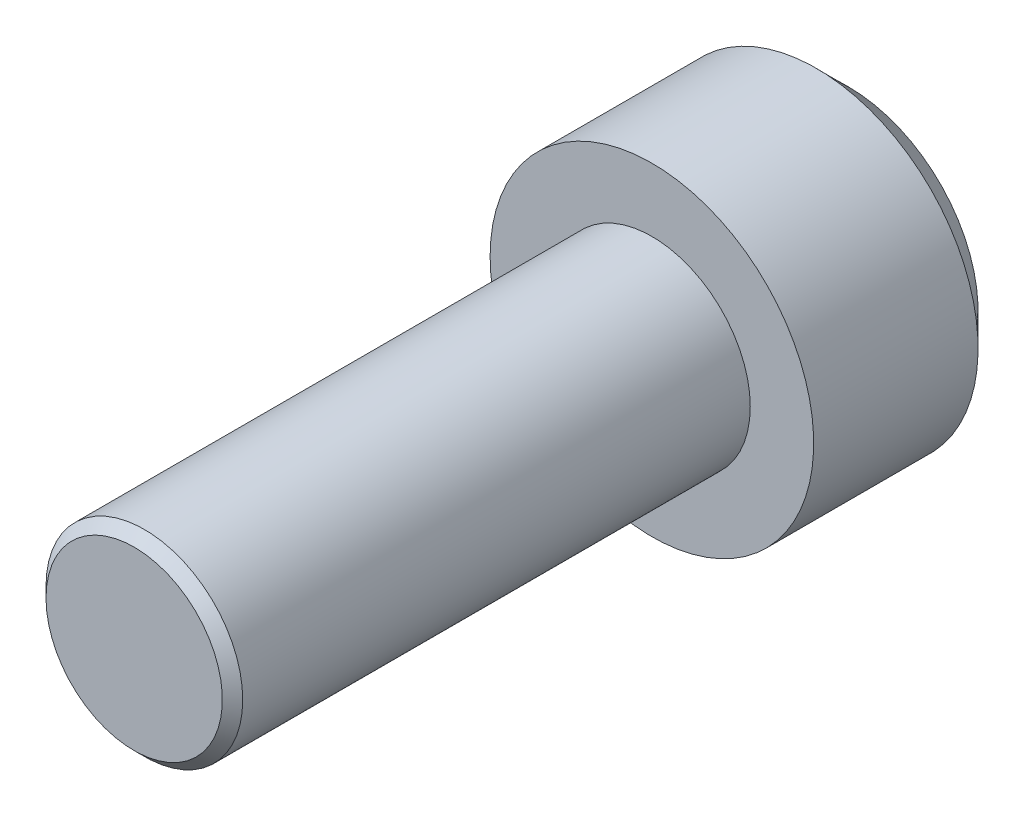
ISO-10303-21;
HEADER;
FILE_DESCRIPTION(('STEP AP214'),'2;1');
FILE_NAME('part.step','',(''),(''),'','','');
FILE_SCHEMA(('AUTOMOTIVE_DESIGN { 1 0 10303 214 1 1 1 1 }'));
ENDSEC;
DATA;
#1=APPLICATION_CONTEXT('core data for automotive mechanical design processes');
#2=APPLICATION_PROTOCOL_DEFINITION('international standard','automotive_design',2000,#1);
#3=PRODUCT_CONTEXT('',#1,'mechanical');
#4=PRODUCT('Part','Part','',(#3));
#5=PRODUCT_RELATED_PRODUCT_CATEGORY('part','',(#4));
#6=PRODUCT_DEFINITION_FORMATION('','',#4);
#7=PRODUCT_DEFINITION_CONTEXT('part definition',#1,'design');
#8=PRODUCT_DEFINITION('design','',#6,#7);
#9=PRODUCT_DEFINITION_SHAPE('','',#8);
#10=(LENGTH_UNIT() NAMED_UNIT(*) SI_UNIT(.MILLI.,.METRE.));
#11=(NAMED_UNIT(*) PLANE_ANGLE_UNIT() SI_UNIT($,.RADIAN.));
#12=(NAMED_UNIT(*) SI_UNIT($,.STERADIAN.) SOLID_ANGLE_UNIT());
#13=UNCERTAINTY_MEASURE_WITH_UNIT(LENGTH_MEASURE(1.E-05),#10,'distance_accuracy_value','');
#14=(GEOMETRIC_REPRESENTATION_CONTEXT(3) GLOBAL_UNCERTAINTY_ASSIGNED_CONTEXT((#13)) GLOBAL_UNIT_ASSIGNED_CONTEXT((#10,
#11,#12)) REPRESENTATION_CONTEXT('',''));
#15=CARTESIAN_POINT('',(0.,0.,0.));
#16=DIRECTION('',(0.,0.,1.));
#17=DIRECTION('',(1.,0.,0.));
#18=AXIS2_PLACEMENT_3D('',#15,#16,#17);
#19=CARTESIAN_POINT('',(75.6412,46.355,-54.2417));
#20=DIRECTION('',(0.,0.,1.));
#21=DIRECTION('',(1.,0.,0.));
#22=AXIS2_PLACEMENT_3D('',#19,#20,#21);
#23=PLANE('',#22);
#24=DIRECTION('',(0.991496436705714,-0.13013383879634,0.));
#25=VECTOR('',#24,1.);
#26=CARTESIAN_POINT('',(75.3829656636386,44.3874992584122,-54.2417));
#27=LINE('',#26,#25);
#28=CARTESIAN_POINT('',(76.5189027464251,44.2384075947999,-54.2417));
#29=VERTEX_POINT('',#28);
#30=CARTESIAN_POINT('',(74.2470285808521,44.5365909220244,-54.2417));
#31=VERTEX_POINT('',#30);
#32=EDGE_CURVE('E126',#29,#31,#27,.F.);
#33=ORIENTED_EDGE('',*,*,#32,.T.);
#34=DIRECTION('',(0.383049008063238,-0.923728021347068,0.));
#35=VECTOR('',#34,1.);
#36=CARTESIAN_POINT('',(73.8081772076394,45.5948871246245,-54.2417));
#37=LINE('',#36,#35);
#38=CARTESIAN_POINT('',(73.369325834427,46.6531833272246,-54.2417));
#39=VERTEX_POINT('',#38);
#40=EDGE_CURVE('E130',#31,#39,#37,.F.);
#41=ORIENTED_EDGE('',*,*,#40,.T.);
#42=DIRECTION('',(-0.608447428642477,-0.793594182550728,0.));
#43=VECTOR('',#42,1.);
#44=CARTESIAN_POINT('',(74.066411544001,47.5623878662123,-54.2417));
#45=LINE('',#44,#43);
#46=CARTESIAN_POINT('',(74.7634972535751,48.4715924052001,-54.2417));
#47=VERTEX_POINT('',#46);
#48=EDGE_CURVE('E134',#39,#47,#45,.F.);
#49=ORIENTED_EDGE('',*,*,#48,.T.);
#50=DIRECTION('',(-0.991496436705714,0.13013383879634,0.));
#51=VECTOR('',#50,1.);
#52=CARTESIAN_POINT('',(75.8994343363616,48.3225007415878,-54.2417));
#53=LINE('',#52,#51);
#54=CARTESIAN_POINT('',(77.0353714191481,48.1734090779755,-54.2417));
#55=VERTEX_POINT('',#54);
#56=EDGE_CURVE('E67',#47,#55,#53,.F.);
#57=ORIENTED_EDGE('',*,*,#56,.T.);
#58=DIRECTION('',(-0.383049008063237,0.923728021347068,0.));
#59=VECTOR('',#58,1.);
#60=CARTESIAN_POINT('',(77.4742227923606,47.1151128753755,-54.2417));
#61=LINE('',#60,#59);
#62=CARTESIAN_POINT('',(77.9130741655732,46.0568166727754,-54.2417));
#63=VERTEX_POINT('',#62);
#64=EDGE_CURVE('E69',#55,#63,#61,.F.);
#65=ORIENTED_EDGE('',*,*,#64,.T.);
#66=DIRECTION('',(0.608447428642477,0.793594182550728,0.));
#67=VECTOR('',#66,1.);
#68=CARTESIAN_POINT('',(77.2159884559992,45.1476121337877,-54.2417));
#69=LINE('',#68,#67);
#70=EDGE_CURVE('E71',#63,#29,#69,.F.);
#71=ORIENTED_EDGE('',*,*,#70,.T.);
#72=EDGE_LOOP('',(#33,#41,#49,#57,#65,#71));
#73=FACE_BOUND('',#72,.T.);
#74=ADVANCED_FACE('F16',(#73),#23,.F.);
#75=CARTESIAN_POINT('',(77.2159884559992,45.1476121337877,-55.3847));
#76=DIRECTION('',(0.793594182550728,-0.608447428642477,0.));
#77=DIRECTION('',(0.608447428642477,0.793594182550728,0.));
#78=AXIS2_PLACEMENT_3D('',#75,#76,#77);
#79=PLANE('',#78);
#80=DIRECTION('',(0.608447428642508,0.793594182550704,0.));
#81=VECTOR('',#80,1.);
#82=CARTESIAN_POINT('',(76.5189027464251,44.2384075947999,-56.5277));
#83=LINE('',#82,#81);
#84=CARTESIAN_POINT('',(76.5189027464251,44.2384075947999,-56.5277));
#85=VERTEX_POINT('',#84);
#86=CARTESIAN_POINT('',(77.9130741655732,46.0568166727754,-56.5277));
#87=VERTEX_POINT('',#86);
#88=EDGE_CURVE('E122',#85,#87,#83,.T.);
#89=ORIENTED_EDGE('',*,*,#88,.F.);
#90=DIRECTION('',(0.,0.,1.));
#91=VECTOR('',#90,1.);
#92=CARTESIAN_POINT('',(76.5189027464251,44.2384075947999,-55.3847));
#93=LINE('',#92,#91);
#94=EDGE_CURVE('E82',#85,#29,#93,.T.);
#95=ORIENTED_EDGE('',*,*,#94,.T.);
#96=ORIENTED_EDGE('',*,*,#70,.F.);
#97=DIRECTION('',(0.,0.,1.));
#98=VECTOR('',#97,1.);
#99=CARTESIAN_POINT('',(77.9130741655732,46.0568166727753,-55.3847));
#100=LINE('',#99,#98);
#101=EDGE_CURVE('E76',#63,#87,#100,.F.);
#102=ORIENTED_EDGE('',*,*,#101,.T.);
#103=EDGE_LOOP('',(#89,#95,#96,#102));
#104=FACE_BOUND('',#103,.T.);
#105=ADVANCED_FACE('F79',(#104),#79,.F.);
#106=CARTESIAN_POINT('',(77.4742227923606,47.1151128753755,-55.3847));
#107=DIRECTION('',(0.923728021347068,0.383049008063237,0.));
#108=DIRECTION('',(-0.383049008063237,0.923728021347068,0.));
#109=AXIS2_PLACEMENT_3D('',#106,#107,#108);
#110=PLANE('',#109);
#111=DIRECTION('',(-0.383049008063222,0.923728021347075,0.));
#112=VECTOR('',#111,1.);
#113=CARTESIAN_POINT('',(77.9130741655732,46.0568166727753,-56.5277));
#114=LINE('',#113,#112);
#115=CARTESIAN_POINT('',(77.0353714191481,48.1734090779755,-56.5277));
#116=VERTEX_POINT('',#115);
#117=EDGE_CURVE('E87',#87,#116,#114,.T.);
#118=ORIENTED_EDGE('',*,*,#117,.F.);
#119=ORIENTED_EDGE('',*,*,#101,.F.);
#120=ORIENTED_EDGE('',*,*,#64,.F.);
#121=DIRECTION('',(0.,0.,1.));
#122=VECTOR('',#121,1.);
#123=CARTESIAN_POINT('',(77.0353714191481,48.1734090779755,-55.3847));
#124=LINE('',#123,#122);
#125=EDGE_CURVE('E90',#55,#116,#124,.F.);
#126=ORIENTED_EDGE('',*,*,#125,.T.);
#127=EDGE_LOOP('',(#118,#119,#120,#126));
#128=FACE_BOUND('',#127,.T.);
#129=ADVANCED_FACE('F85',(#128),#110,.F.);
#130=CARTESIAN_POINT('',(75.8994343363616,48.3225007415878,-55.3847));
#131=DIRECTION('',(0.13013383879634,0.991496436705714,0.));
#132=DIRECTION('',(-0.991496436705714,0.13013383879634,0.));
#133=AXIS2_PLACEMENT_3D('',#130,#131,#132);
#134=PLANE('',#133);
#135=DIRECTION('',(-0.991496436705716,0.130133838796329,0.));
#136=VECTOR('',#135,1.);
#137=CARTESIAN_POINT('',(77.0353714191481,48.1734090779756,-56.5277));
#138=LINE('',#137,#136);
#139=CARTESIAN_POINT('',(74.7634972535751,48.4715924052001,-56.5277));
#140=VERTEX_POINT('',#139);
#141=EDGE_CURVE('E118',#116,#140,#138,.T.);
#142=ORIENTED_EDGE('',*,*,#141,.F.);
#143=ORIENTED_EDGE('',*,*,#125,.F.);
#144=ORIENTED_EDGE('',*,*,#56,.F.);
#145=DIRECTION('',(0.,0.,1.));
#146=VECTOR('',#145,1.);
#147=CARTESIAN_POINT('',(74.7634972535751,48.4715924052002,-55.3847));
#148=LINE('',#147,#146);
#149=EDGE_CURVE('E132',#47,#140,#148,.F.);
#150=ORIENTED_EDGE('',*,*,#149,.T.);
#151=EDGE_LOOP('',(#142,#143,#144,#150));
#152=FACE_BOUND('',#151,.T.);
#153=ADVANCED_FACE('F137',(#152),#134,.F.);
#154=CARTESIAN_POINT('',(74.066411544001,47.5623878662123,-55.3847));
#155=DIRECTION('',(-0.793594182550728,0.608447428642477,0.));
#156=DIRECTION('',(-0.608447428642477,-0.793594182550728,0.));
#157=AXIS2_PLACEMENT_3D('',#154,#155,#156);
#158=PLANE('',#157);
#159=DIRECTION('',(-0.608447428642508,-0.793594182550704,0.));
#160=VECTOR('',#159,1.);
#161=CARTESIAN_POINT('',(74.7634972535751,48.4715924052002,-56.5277));
#162=LINE('',#161,#160);
#163=CARTESIAN_POINT('',(73.369325834427,46.6531833272246,-56.5277));
#164=VERTEX_POINT('',#163);
#165=EDGE_CURVE('E115',#140,#164,#162,.T.);
#166=ORIENTED_EDGE('',*,*,#165,.F.);
#167=ORIENTED_EDGE('',*,*,#149,.F.);
#168=ORIENTED_EDGE('',*,*,#48,.F.);
#169=DIRECTION('',(0.,0.,1.));
#170=VECTOR('',#169,1.);
#171=CARTESIAN_POINT('',(73.3693258344269,46.6531833272246,-55.3847));
#172=LINE('',#171,#170);
#173=EDGE_CURVE('E128',#39,#164,#172,.F.);
#174=ORIENTED_EDGE('',*,*,#173,.T.);
#175=EDGE_LOOP('',(#166,#167,#168,#174));
#176=FACE_BOUND('',#175,.T.);
#177=ADVANCED_FACE('F149',(#176),#158,.F.);
#178=CARTESIAN_POINT('',(73.8081772076394,45.5948871246245,-55.3847));
#179=DIRECTION('',(-0.923728021347068,-0.383049008063238,0.));
#180=DIRECTION('',(0.383049008063238,-0.923728021347068,0.));
#181=AXIS2_PLACEMENT_3D('',#178,#179,#180);
#182=PLANE('',#181);
#183=DIRECTION('',(0.383049008063211,-0.923728021347079,0.));
#184=VECTOR('',#183,1.);
#185=CARTESIAN_POINT('',(73.369325834427,46.6531833272247,-56.5277));
#186=LINE('',#185,#184);
#187=CARTESIAN_POINT('',(74.247028580852,44.5365909220244,-56.5277));
#188=VERTEX_POINT('',#187);
#189=EDGE_CURVE('E112',#164,#188,#186,.T.);
#190=ORIENTED_EDGE('',*,*,#189,.F.);
#191=ORIENTED_EDGE('',*,*,#173,.F.);
#192=ORIENTED_EDGE('',*,*,#40,.F.);
#193=DIRECTION('',(0.,0.,1.));
#194=VECTOR('',#193,1.);
#195=CARTESIAN_POINT('',(74.2470285808521,44.5365909220245,-55.3847));
#196=LINE('',#195,#194);
#197=EDGE_CURVE('E34',#31,#188,#196,.F.);
#198=ORIENTED_EDGE('',*,*,#197,.T.);
#199=EDGE_LOOP('',(#190,#191,#192,#198));
#200=FACE_BOUND('',#199,.T.);
#201=ADVANCED_FACE('F147',(#200),#182,.F.);
#202=CARTESIAN_POINT('',(75.3829656636386,44.3874992584122,-55.3847));
#203=DIRECTION('',(-0.13013383879634,-0.991496436705714,0.));
#204=DIRECTION('',(0.991496436705714,-0.13013383879634,0.));
#205=AXIS2_PLACEMENT_3D('',#202,#203,#204);
#206=PLANE('',#205);
#207=DIRECTION('',(0.991496436705721,-0.130133838796285,0.));
#208=VECTOR('',#207,1.);
#209=CARTESIAN_POINT('',(74.2470285808521,44.5365909220243,-56.5277));
#210=LINE('',#209,#208);
#211=EDGE_CURVE('E108',#188,#85,#210,.T.);
#212=ORIENTED_EDGE('',*,*,#211,.F.);
#213=ORIENTED_EDGE('',*,*,#197,.F.);
#214=ORIENTED_EDGE('',*,*,#32,.F.);
#215=ORIENTED_EDGE('',*,*,#94,.F.);
#216=EDGE_LOOP('',(#212,#213,#214,#215));
#217=FACE_BOUND('',#216,.T.);
#218=ADVANCED_FACE('F144',(#217),#206,.F.);
#219=CARTESIAN_POINT('',(75.6412,46.355,-56.5277));
#220=DIRECTION('',(0.,0.,-1.));
#221=DIRECTION('',(-1.,0.,0.));
#222=AXIS2_PLACEMENT_3D('',#219,#220,#221);
#223=PLANE('',#222);
#224=ORIENTED_EDGE('',*,*,#189,.T.);
#225=ORIENTED_EDGE('',*,*,#211,.T.);
#226=ORIENTED_EDGE('',*,*,#88,.T.);
#227=ORIENTED_EDGE('',*,*,#117,.T.);
#228=ORIENTED_EDGE('',*,*,#141,.T.);
#229=ORIENTED_EDGE('',*,*,#165,.T.);
#230=EDGE_LOOP('',(#224,#225,#226,#227,#228,#229));
#231=FACE_BOUND('',#230,.T.);
#232=CARTESIAN_POINT('',(75.6412,46.355,-56.5277000007427));
#233=DIRECTION('',(0.,0.,1.));
#234=DIRECTION('',(0.,-1.,0.));
#235=AXIS2_PLACEMENT_3D('',#232,#233,#234);
#236=CIRCLE('',#235,3.17500000074461);
#237=CARTESIAN_POINT('',(75.6412,43.1799999992554,-56.5277000007427));
#238=VERTEX_POINT('',#237);
#239=EDGE_CURVE('E19',#238,#238,#236,.T.);
#240=ORIENTED_EDGE('',*,*,#239,.F.);
#241=EDGE_LOOP('',(#240));
#242=FACE_BOUND('',#241,.T.);
#243=ADVANCED_FACE('F141',(#231,#242),#223,.T.);
#244=CARTESIAN_POINT('',(75.6412,46.355,-55.7339500001035));
#245=DIRECTION('',(0.,0.,1.));
#246=DIRECTION('',(0.,-1.,0.));
#247=AXIS2_PLACEMENT_3D('',#244,#245,#246);
#248=CONICAL_SURFACE('',#247,3.96874999990587,0.785398162466469);
#249=CARTESIAN_POINT('',(75.6412,46.355,-55.73395));
#250=DIRECTION('',(0.,0.,-1.));
#251=DIRECTION('',(-1.,0.,0.));
#252=AXIS2_PLACEMENT_3D('',#249,#250,#251);
#253=CIRCLE('',#252,3.96875000000001);
#254=CARTESIAN_POINT('',(71.67245,46.355,-55.73395));
#255=VERTEX_POINT('',#254);
#256=EDGE_CURVE('E100',#255,#255,#253,.F.);
#257=ORIENTED_EDGE('',*,*,#256,.F.);
#258=EDGE_LOOP('',(#257));
#259=FACE_BOUND('',#258,.T.);
#260=ORIENTED_EDGE('',*,*,#239,.T.);
#261=EDGE_LOOP('',(#260));
#262=FACE_BOUND('',#261,.T.);
#263=ADVANCED_FACE('F181',(#259,#262),#248,.T.);
#264=CARTESIAN_POINT('',(75.6412,46.355,-51.7017));
#265=DIRECTION('',(0.,0.,-1.));
#266=DIRECTION('',(-1.,0.,0.));
#267=AXIS2_PLACEMENT_3D('',#264,#265,#266);
#268=CYLINDRICAL_SURFACE('',#267,3.96875000000001);
#269=ORIENTED_EDGE('',*,*,#256,.T.);
#270=EDGE_LOOP('',(#269));
#271=FACE_BOUND('',#270,.T.);
#272=CARTESIAN_POINT('',(75.6412,46.355,-51.7017));
#273=DIRECTION('',(0.,0.,-1.));
#274=DIRECTION('',(-1.,0.,0.));
#275=AXIS2_PLACEMENT_3D('',#272,#273,#274);
#276=CIRCLE('',#275,3.96875000000001);
#277=CARTESIAN_POINT('',(71.67245,46.355,-51.7017));
#278=VERTEX_POINT('',#277);
#279=EDGE_CURVE('E98',#278,#278,#276,.F.);
#280=ORIENTED_EDGE('',*,*,#279,.F.);
#281=EDGE_LOOP('',(#280));
#282=FACE_BOUND('',#281,.T.);
#283=ADVANCED_FACE('F177',(#271,#282),#268,.T.);
#284=CARTESIAN_POINT('',(75.6412,46.355,-39.0017));
#285=DIRECTION('',(0.,0.,1.));
#286=DIRECTION('',(1.,0.,0.));
#287=AXIS2_PLACEMENT_3D('',#284,#285,#286);
#288=PLANE('',#287);
#289=CARTESIAN_POINT('',(75.6412,46.355,-39.0017000000284));
#290=DIRECTION('',(0.,0.,-1.));
#291=DIRECTION('',(-1.,0.,0.));
#292=AXIS2_PLACEMENT_3D('',#289,#290,#291);
#293=CIRCLE('',#292,2.16299999998909);
#294=CARTESIAN_POINT('',(73.4782000000109,46.355,-39.0017000000284));
#295=VERTEX_POINT('',#294);
#296=EDGE_CURVE('E96',#295,#295,#293,.T.);
#297=ORIENTED_EDGE('',*,*,#296,.F.);
#298=EDGE_LOOP('',(#297));
#299=FACE_BOUND('',#298,.T.);
#300=ADVANCED_FACE('F174',(#299),#288,.T.);
#301=CARTESIAN_POINT('',(75.6412,46.355,-51.7017));
#302=DIRECTION('',(0.,0.,1.));
#303=DIRECTION('',(1.,0.,0.));
#304=AXIS2_PLACEMENT_3D('',#301,#302,#303);
#305=PLANE('',#304);
#306=ORIENTED_EDGE('',*,*,#279,.T.);
#307=EDGE_LOOP('',(#306));
#308=FACE_BOUND('',#307,.T.);
#309=CARTESIAN_POINT('',(75.6412,46.355,-51.7017));
#310=DIRECTION('',(0.,0.,1.));
#311=DIRECTION('',(1.,0.,0.));
#312=AXIS2_PLACEMENT_3D('',#309,#310,#311);
#313=CIRCLE('',#312,2.413);
#314=CARTESIAN_POINT('',(78.0542,46.355,-51.7017));
#315=VERTEX_POINT('',#314);
#316=EDGE_CURVE('E25',#315,#315,#313,.T.);
#317=ORIENTED_EDGE('',*,*,#316,.F.);
#318=EDGE_LOOP('',(#317));
#319=FACE_BOUND('',#318,.T.);
#320=ADVANCED_FACE('F167',(#308,#319),#305,.T.);
#321=CARTESIAN_POINT('',(75.6412,46.355,-39.2517000000225));
#322=DIRECTION('',(0.,0.,-1.));
#323=DIRECTION('',(-1.,0.,0.));
#324=AXIS2_PLACEMENT_3D('',#321,#322,#323);
#325=CONICAL_SURFACE('',#324,2.41299999998318,0.785398163397448);
#326=CARTESIAN_POINT('',(75.6412,46.355,-39.2517));
#327=DIRECTION('',(0.,0.,1.));
#328=DIRECTION('',(1.,0.,0.));
#329=AXIS2_PLACEMENT_3D('',#326,#327,#328);
#330=CIRCLE('',#329,2.413);
#331=CARTESIAN_POINT('',(78.0542,46.355,-39.2517));
#332=VERTEX_POINT('',#331);
#333=EDGE_CURVE('E11',#332,#332,#330,.F.);
#334=ORIENTED_EDGE('',*,*,#333,.F.);
#335=EDGE_LOOP('',(#334));
#336=FACE_BOUND('',#335,.T.);
#337=ORIENTED_EDGE('',*,*,#296,.T.);
#338=EDGE_LOOP('',(#337));
#339=FACE_BOUND('',#338,.T.);
#340=ADVANCED_FACE('F161',(#336,#339),#325,.T.);
#341=CARTESIAN_POINT('',(75.6412,46.355,-51.7017));
#342=DIRECTION('',(0.,0.,1.));
#343=DIRECTION('',(1.,0.,0.));
#344=AXIS2_PLACEMENT_3D('',#341,#342,#343);
#345=CYLINDRICAL_SURFACE('',#344,2.413);
#346=ORIENTED_EDGE('',*,*,#333,.T.);
#347=EDGE_LOOP('',(#346));
#348=FACE_BOUND('',#347,.T.);
#349=ORIENTED_EDGE('',*,*,#316,.T.);
#350=EDGE_LOOP('',(#349));
#351=FACE_BOUND('',#350,.T.);
#352=ADVANCED_FACE('F159',(#348,#351),#345,.T.);
#353=CLOSED_SHELL('',(#74,#105,#129,#153,#177,#201,#218,#243,#263,#283,#300,#320,#340,#352));
#354=MANIFOLD_SOLID_BREP('B1',#353);
#355=ADVANCED_BREP_SHAPE_REPRESENTATION('',(#18,#354),#14);
#356=SHAPE_DEFINITION_REPRESENTATION(#9,#355);
ENDSEC;
END-ISO-10303-21;
